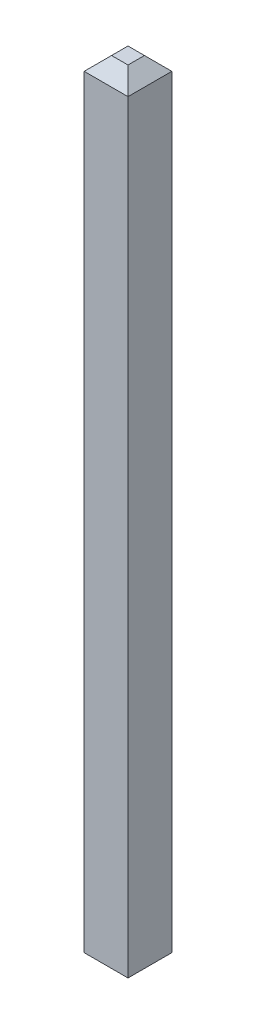
ISO-10303-21;
HEADER;
FILE_DESCRIPTION(('STEP AP214'),'2;1');
FILE_NAME('part.step','',(''),(''),'','','');
FILE_SCHEMA(('AUTOMOTIVE_DESIGN { 1 0 10303 214 1 1 1 1 }'));
ENDSEC;
DATA;
#1=APPLICATION_CONTEXT('core data for automotive mechanical design processes');
#2=APPLICATION_PROTOCOL_DEFINITION('international standard','automotive_design',2000,#1);
#3=PRODUCT_CONTEXT('',#1,'mechanical');
#4=PRODUCT('Part','Part','',(#3));
#5=PRODUCT_RELATED_PRODUCT_CATEGORY('part','',(#4));
#6=PRODUCT_DEFINITION_FORMATION('','',#4);
#7=PRODUCT_DEFINITION_CONTEXT('part definition',#1,'design');
#8=PRODUCT_DEFINITION('design','',#6,#7);
#9=PRODUCT_DEFINITION_SHAPE('','',#8);
#10=(LENGTH_UNIT() NAMED_UNIT(*) SI_UNIT(.MILLI.,.METRE.));
#11=(NAMED_UNIT(*) PLANE_ANGLE_UNIT() SI_UNIT($,.RADIAN.));
#12=(NAMED_UNIT(*) SI_UNIT($,.STERADIAN.) SOLID_ANGLE_UNIT());
#13=UNCERTAINTY_MEASURE_WITH_UNIT(LENGTH_MEASURE(1.E-05),#10,'distance_accuracy_value','');
#14=(GEOMETRIC_REPRESENTATION_CONTEXT(3) GLOBAL_UNCERTAINTY_ASSIGNED_CONTEXT((#13)) GLOBAL_UNIT_ASSIGNED_CONTEXT((#10,
#11,#12)) REPRESENTATION_CONTEXT('',''));
#15=CARTESIAN_POINT('',(0.,0.,0.));
#16=DIRECTION('',(0.,0.,1.));
#17=DIRECTION('',(1.,0.,0.));
#18=AXIS2_PLACEMENT_3D('',#15,#16,#17);
#19=CARTESIAN_POINT('',(-3.49,7.07,-0.32));
#20=DIRECTION('',(-0.707106781186548,-0.707106781186548,0.));
#21=DIRECTION('',(-0.707106781186548,0.707106781186548,0.));
#22=AXIS2_PLACEMENT_3D('',#19,#20,#21);
#23=PLANE('',#22);
#24=DIRECTION('',(0.577350269189626,-0.577350269189626,0.577350269189626));
#25=VECTOR('',#24,1.);
#26=CARTESIAN_POINT('',(-3.703333333333,7.283333333333,0.106666666667));
#27=LINE('',#26,#25);
#28=CARTESIAN_POINT('',(-3.69,7.27,0.12));
#29=VERTEX_POINT('',#28);
#30=CARTESIAN_POINT('',(-3.49,7.07,0.32));
#31=VERTEX_POINT('',#30);
#32=EDGE_CURVE('E72',#29,#31,#27,.T.);
#33=ORIENTED_EDGE('',*,*,#32,.T.);
#34=DIRECTION('',(0.,0.,1.));
#35=VECTOR('',#34,1.);
#36=CARTESIAN_POINT('',(-3.49,7.07,-0.32));
#37=LINE('',#36,#35);
#38=CARTESIAN_POINT('',(-3.49,7.07,-0.32));
#39=VERTEX_POINT('',#38);
#40=EDGE_CURVE('E166',#39,#31,#37,.T.);
#41=ORIENTED_EDGE('',*,*,#40,.F.);
#42=DIRECTION('',(0.577350269189626,-0.577350269189626,-0.577350269189626));
#43=VECTOR('',#42,1.);
#44=CARTESIAN_POINT('',(-3.49,7.07,-0.32));
#45=LINE('',#44,#43);
#46=CARTESIAN_POINT('',(-3.69,7.27,-0.12));
#47=VERTEX_POINT('',#46);
#48=EDGE_CURVE('E11',#47,#39,#45,.T.);
#49=ORIENTED_EDGE('',*,*,#48,.F.);
#50=DIRECTION('',(0.,0.,-1.));
#51=VECTOR('',#50,1.);
#52=CARTESIAN_POINT('',(-3.69,7.27,-0.32));
#53=LINE('',#52,#51);
#54=EDGE_CURVE('E167',#29,#47,#53,.T.);
#55=ORIENTED_EDGE('',*,*,#54,.F.);
#56=EDGE_LOOP('',(#33,#41,#49,#55));
#57=FACE_BOUND('',#56,.T.);
#58=ADVANCED_FACE('F17',(#57),#23,.F.);
#59=CARTESIAN_POINT('',(-3.81,7.07,-0.32));
#60=DIRECTION('',(0.,0.707106781186548,-0.707106781186548));
#61=DIRECTION('',(-1.,0.,0.));
#62=AXIS2_PLACEMENT_3D('',#59,#60,#61);
#63=PLANE('',#62);
#64=DIRECTION('',(0.577350269189626,0.577350269189626,0.577350269189626));
#65=VECTOR('',#64,1.);
#66=CARTESIAN_POINT('',(-3.996666666667,7.203333333333,-0.186666666667));
#67=LINE('',#66,#65);
#68=CARTESIAN_POINT('',(-4.13,7.07,-0.32));
#69=VERTEX_POINT('',#68);
#70=CARTESIAN_POINT('',(-3.93,7.27,-0.12));
#71=VERTEX_POINT('',#70);
#72=EDGE_CURVE('E26',#69,#71,#67,.T.);
#73=ORIENTED_EDGE('',*,*,#72,.T.);
#74=DIRECTION('',(-1.,0.,0.));
#75=VECTOR('',#74,1.);
#76=CARTESIAN_POINT('',(-4.13,7.27,-0.12));
#77=LINE('',#76,#75);
#78=EDGE_CURVE('E171',#47,#71,#77,.T.);
#79=ORIENTED_EDGE('',*,*,#78,.F.);
#80=ORIENTED_EDGE('',*,*,#48,.T.);
#81=DIRECTION('',(1.,0.,0.));
#82=VECTOR('',#81,1.);
#83=CARTESIAN_POINT('',(-3.49,7.07,-0.32));
#84=LINE('',#83,#82);
#85=EDGE_CURVE('E154',#69,#39,#84,.T.);
#86=ORIENTED_EDGE('',*,*,#85,.F.);
#87=EDGE_LOOP('',(#73,#79,#80,#86));
#88=FACE_BOUND('',#87,.T.);
#89=ADVANCED_FACE('F188',(#88),#63,.T.);
#90=CARTESIAN_POINT('',(-3.93,7.27,-0.32));
#91=DIRECTION('',(0.707106781186548,-0.707106781186548,0.));
#92=DIRECTION('',(0.,0.,-1.));
#93=AXIS2_PLACEMENT_3D('',#90,#91,#92);
#94=PLANE('',#93);
#95=DIRECTION('',(-0.577350269189626,-0.577350269189626,0.577350269189626));
#96=VECTOR('',#95,1.);
#97=CARTESIAN_POINT('',(-3.996666666667,7.203333333333,0.186666666667));
#98=LINE('',#97,#96);
#99=CARTESIAN_POINT('',(-3.93,7.27,0.12));
#100=VERTEX_POINT('',#99);
#101=CARTESIAN_POINT('',(-4.13,7.07,0.32));
#102=VERTEX_POINT('',#101);
#103=EDGE_CURVE('E39',#100,#102,#98,.T.);
#104=ORIENTED_EDGE('',*,*,#103,.F.);
#105=DIRECTION('',(0.,0.,1.));
#106=VECTOR('',#105,1.);
#107=CARTESIAN_POINT('',(-3.93,7.27,-0.32));
#108=LINE('',#107,#106);
#109=EDGE_CURVE('E175',#71,#100,#108,.T.);
#110=ORIENTED_EDGE('',*,*,#109,.F.);
#111=ORIENTED_EDGE('',*,*,#72,.F.);
#112=DIRECTION('',(0.,0.,-1.));
#113=VECTOR('',#112,1.);
#114=CARTESIAN_POINT('',(-4.13,7.07,-0.32));
#115=LINE('',#114,#113);
#116=EDGE_CURVE('E139',#102,#69,#115,.T.);
#117=ORIENTED_EDGE('',*,*,#116,.F.);
#118=EDGE_LOOP('',(#104,#110,#111,#117));
#119=FACE_BOUND('',#118,.T.);
#120=ADVANCED_FACE('F190',(#119),#94,.F.);
#121=CARTESIAN_POINT('',(-4.13,7.27,0.12));
#122=DIRECTION('',(0.,-0.707106781186548,-0.707106781186548));
#123=DIRECTION('',(0.,-0.707106781186548,0.707106781186548));
#124=AXIS2_PLACEMENT_3D('',#121,#122,#123);
#125=PLANE('',#124);
#126=ORIENTED_EDGE('',*,*,#32,.F.);
#127=DIRECTION('',(1.,0.,0.));
#128=VECTOR('',#127,1.);
#129=CARTESIAN_POINT('',(-4.13,7.27,0.12));
#130=LINE('',#129,#128);
#131=EDGE_CURVE('E179',#100,#29,#130,.T.);
#132=ORIENTED_EDGE('',*,*,#131,.F.);
#133=ORIENTED_EDGE('',*,*,#103,.T.);
#134=DIRECTION('',(-1.,0.,0.));
#135=VECTOR('',#134,1.);
#136=CARTESIAN_POINT('',(-3.81,7.07,0.32));
#137=LINE('',#136,#135);
#138=EDGE_CURVE('E143',#31,#102,#137,.T.);
#139=ORIENTED_EDGE('',*,*,#138,.F.);
#140=EDGE_LOOP('',(#126,#132,#133,#139));
#141=FACE_BOUND('',#140,.T.);
#142=ADVANCED_FACE('F272',(#141),#125,.F.);
#143=CARTESIAN_POINT('',(-4.13,7.27,-0.32));
#144=DIRECTION('',(0.,-1.,0.));
#145=DIRECTION('',(0.,0.,-1.));
#146=AXIS2_PLACEMENT_3D('',#143,#144,#145);
#147=PLANE('',#146);
#148=ORIENTED_EDGE('',*,*,#54,.T.);
#149=ORIENTED_EDGE('',*,*,#78,.T.);
#150=ORIENTED_EDGE('',*,*,#109,.T.);
#151=ORIENTED_EDGE('',*,*,#131,.T.);
#152=EDGE_LOOP('',(#148,#149,#150,#151));
#153=FACE_BOUND('',#152,.T.);
#154=ADVANCED_FACE('F192',(#153),#147,.F.);
#155=CARTESIAN_POINT('',(-3.49,7.27,-0.32));
#156=DIRECTION('',(-1.,0.,0.));
#157=DIRECTION('',(0.,1.,0.));
#158=AXIS2_PLACEMENT_3D('',#155,#156,#157);
#159=PLANE('',#158);
#160=DIRECTION('',(0.,-1.,0.));
#161=VECTOR('',#160,1.);
#162=CARTESIAN_POINT('',(-3.49,7.27,-0.32));
#163=LINE('',#162,#161);
#164=CARTESIAN_POINT('',(-3.49,-4.07,-0.32));
#165=VERTEX_POINT('',#164);
#166=EDGE_CURVE('E145',#39,#165,#163,.T.);
#167=ORIENTED_EDGE('',*,*,#166,.F.);
#168=ORIENTED_EDGE('',*,*,#40,.T.);
#169=DIRECTION('',(0.,-1.,0.));
#170=VECTOR('',#169,1.);
#171=CARTESIAN_POINT('',(-3.49,7.27,0.32));
#172=LINE('',#171,#170);
#173=CARTESIAN_POINT('',(-3.49,-4.07,0.32));
#174=VERTEX_POINT('',#173);
#175=EDGE_CURVE('E63',#31,#174,#172,.T.);
#176=ORIENTED_EDGE('',*,*,#175,.T.);
#177=DIRECTION('',(0.,0.,-1.));
#178=VECTOR('',#177,1.);
#179=CARTESIAN_POINT('',(-3.49,-4.07,-0.32));
#180=LINE('',#179,#178);
#181=EDGE_CURVE('E117',#174,#165,#180,.T.);
#182=ORIENTED_EDGE('',*,*,#181,.T.);
#183=EDGE_LOOP('',(#167,#168,#176,#182));
#184=FACE_BOUND('',#183,.T.);
#185=ADVANCED_FACE('F195',(#184),#159,.F.);
#186=CARTESIAN_POINT('',(-3.81,1.5,0.32));
#187=DIRECTION('',(0.,0.,-1.));
#188=DIRECTION('',(0.,-1.,0.));
#189=AXIS2_PLACEMENT_3D('',#186,#187,#188);
#190=PLANE('',#189);
#191=ORIENTED_EDGE('',*,*,#175,.F.);
#192=ORIENTED_EDGE('',*,*,#138,.T.);
#193=DIRECTION('',(0.,1.,0.));
#194=VECTOR('',#193,1.);
#195=CARTESIAN_POINT('',(-4.13,-4.27,0.32));
#196=LINE('',#195,#194);
#197=CARTESIAN_POINT('',(-4.13,-4.07,0.32));
#198=VERTEX_POINT('',#197);
#199=EDGE_CURVE('E134',#198,#102,#196,.T.);
#200=ORIENTED_EDGE('',*,*,#199,.F.);
#201=DIRECTION('',(1.,0.,0.));
#202=VECTOR('',#201,1.);
#203=CARTESIAN_POINT('',(-3.81,-4.07,0.32));
#204=LINE('',#203,#202);
#205=EDGE_CURVE('E106',#198,#174,#204,.T.);
#206=ORIENTED_EDGE('',*,*,#205,.T.);
#207=EDGE_LOOP('',(#191,#192,#200,#206));
#208=FACE_BOUND('',#207,.T.);
#209=ADVANCED_FACE('F142',(#208),#190,.F.);
#210=CARTESIAN_POINT('',(-3.69,-4.27,-0.32));
#211=DIRECTION('',(-0.707106781186548,0.707106781186548,0.));
#212=DIRECTION('',(0.,0.,1.));
#213=AXIS2_PLACEMENT_3D('',#210,#211,#212);
#214=PLANE('',#213);
#215=DIRECTION('',(-0.577350269189626,-0.577350269189626,0.577350269189626));
#216=VECTOR('',#215,1.);
#217=CARTESIAN_POINT('',(-3.623333333333,-4.203333333333,-0.186666666667));
#218=LINE('',#217,#216);
#219=CARTESIAN_POINT('',(-3.69,-4.27,-0.12));
#220=VERTEX_POINT('',#219);
#221=EDGE_CURVE('E204',#165,#220,#218,.T.);
#222=ORIENTED_EDGE('',*,*,#221,.F.);
#223=ORIENTED_EDGE('',*,*,#181,.F.);
#224=DIRECTION('',(-0.577350269189626,-0.577350269189626,-0.577350269189626));
#225=VECTOR('',#224,1.);
#226=CARTESIAN_POINT('',(-3.836666666667,-4.416666666667,-0.02666666666667));
#227=LINE('',#226,#225);
#228=CARTESIAN_POINT('',(-3.69,-4.27,0.12));
#229=VERTEX_POINT('',#228);
#230=EDGE_CURVE('E113',#174,#229,#227,.T.);
#231=ORIENTED_EDGE('',*,*,#230,.T.);
#232=DIRECTION('',(0.,0.,1.));
#233=VECTOR('',#232,1.);
#234=CARTESIAN_POINT('',(-3.69,-4.27,-0.32));
#235=LINE('',#234,#233);
#236=EDGE_CURVE('E231',#220,#229,#235,.T.);
#237=ORIENTED_EDGE('',*,*,#236,.F.);
#238=EDGE_LOOP('',(#222,#223,#231,#237));
#239=FACE_BOUND('',#238,.T.);
#240=ADVANCED_FACE('F233',(#239),#214,.F.);
#241=CARTESIAN_POINT('',(-3.49,-4.27,0.12));
#242=DIRECTION('',(0.,0.707106781186548,-0.707106781186548));
#243=DIRECTION('',(-1.,0.,0.));
#244=AXIS2_PLACEMENT_3D('',#241,#242,#243);
#245=PLANE('',#244);
#246=ORIENTED_EDGE('',*,*,#230,.F.);
#247=ORIENTED_EDGE('',*,*,#205,.F.);
#248=DIRECTION('',(-0.577350269189626,0.577350269189626,0.577350269189626));
#249=VECTOR('',#248,1.);
#250=CARTESIAN_POINT('',(-3.916666666667,-4.283333333333,0.106666666667));
#251=LINE('',#250,#249);
#252=CARTESIAN_POINT('',(-3.93,-4.27,0.12));
#253=VERTEX_POINT('',#252);
#254=EDGE_CURVE('E110',#253,#198,#251,.T.);
#255=ORIENTED_EDGE('',*,*,#254,.F.);
#256=DIRECTION('',(-1.,0.,0.));
#257=VECTOR('',#256,1.);
#258=CARTESIAN_POINT('',(-3.49,-4.27,0.12));
#259=LINE('',#258,#257);
#260=EDGE_CURVE('E235',#229,#253,#259,.T.);
#261=ORIENTED_EDGE('',*,*,#260,.F.);
#262=EDGE_LOOP('',(#246,#247,#255,#261));
#263=FACE_BOUND('',#262,.T.);
#264=ADVANCED_FACE('F108',(#263),#245,.F.);
#265=CARTESIAN_POINT('',(-4.13,-4.07,-0.32));
#266=DIRECTION('',(0.707106781186548,0.707106781186548,0.));
#267=DIRECTION('',(0.,0.,-1.));
#268=AXIS2_PLACEMENT_3D('',#265,#266,#267);
#269=PLANE('',#268);
#270=DIRECTION('',(0.577350269189626,-0.577350269189626,0.577350269189626));
#271=VECTOR('',#270,1.);
#272=CARTESIAN_POINT('',(-4.023333333333,-4.176666666667,-0.213333333333));
#273=LINE('',#272,#271);
#274=CARTESIAN_POINT('',(-4.13,-4.07,-0.32));
#275=VERTEX_POINT('',#274);
#276=CARTESIAN_POINT('',(-3.93,-4.27,-0.12));
#277=VERTEX_POINT('',#276);
#278=EDGE_CURVE('E212',#275,#277,#273,.T.);
#279=ORIENTED_EDGE('',*,*,#278,.T.);
#280=DIRECTION('',(0.,0.,-1.));
#281=VECTOR('',#280,1.);
#282=CARTESIAN_POINT('',(-3.93,-4.27,-0.32));
#283=LINE('',#282,#281);
#284=EDGE_CURVE('E126',#253,#277,#283,.T.);
#285=ORIENTED_EDGE('',*,*,#284,.F.);
#286=ORIENTED_EDGE('',*,*,#254,.T.);
#287=DIRECTION('',(0.,0.,1.));
#288=VECTOR('',#287,1.);
#289=CARTESIAN_POINT('',(-4.13,-4.07,-0.32));
#290=LINE('',#289,#288);
#291=EDGE_CURVE('E123',#275,#198,#290,.T.);
#292=ORIENTED_EDGE('',*,*,#291,.F.);
#293=EDGE_LOOP('',(#279,#285,#286,#292));
#294=FACE_BOUND('',#293,.T.);
#295=ADVANCED_FACE('F122',(#294),#269,.F.);
#296=CARTESIAN_POINT('',(-4.13,-4.27,-0.32));
#297=DIRECTION('',(1.,0.,0.));
#298=DIRECTION('',(0.,0.,1.));
#299=AXIS2_PLACEMENT_3D('',#296,#297,#298);
#300=PLANE('',#299);
#301=ORIENTED_EDGE('',*,*,#199,.T.);
#302=ORIENTED_EDGE('',*,*,#116,.T.);
#303=DIRECTION('',(0.,1.,0.));
#304=VECTOR('',#303,1.);
#305=CARTESIAN_POINT('',(-4.13,-4.27,-0.32));
#306=LINE('',#305,#304);
#307=EDGE_CURVE('E136',#275,#69,#306,.T.);
#308=ORIENTED_EDGE('',*,*,#307,.F.);
#309=ORIENTED_EDGE('',*,*,#291,.T.);
#310=EDGE_LOOP('',(#301,#302,#308,#309));
#311=FACE_BOUND('',#310,.T.);
#312=ADVANCED_FACE('F132',(#311),#300,.F.);
#313=CARTESIAN_POINT('',(-3.81,1.5,-0.32));
#314=DIRECTION('',(0.,0.,-1.));
#315=DIRECTION('',(0.,-1.,0.));
#316=AXIS2_PLACEMENT_3D('',#313,#314,#315);
#317=PLANE('',#316);
#318=ORIENTED_EDGE('',*,*,#307,.T.);
#319=ORIENTED_EDGE('',*,*,#85,.T.);
#320=ORIENTED_EDGE('',*,*,#166,.T.);
#321=DIRECTION('',(-1.,0.,0.));
#322=VECTOR('',#321,1.);
#323=CARTESIAN_POINT('',(-4.13,-4.07,-0.32));
#324=LINE('',#323,#322);
#325=EDGE_CURVE('E209',#165,#275,#324,.T.);
#326=ORIENTED_EDGE('',*,*,#325,.T.);
#327=EDGE_LOOP('',(#318,#319,#320,#326));
#328=FACE_BOUND('',#327,.T.);
#329=ADVANCED_FACE('F198',(#328),#317,.T.);
#330=CARTESIAN_POINT('',(-3.81,-4.07,-0.32));
#331=DIRECTION('',(0.,-0.707106781186548,-0.707106781186548));
#332=DIRECTION('',(0.,-0.707106781186548,0.707106781186548));
#333=AXIS2_PLACEMENT_3D('',#330,#331,#332);
#334=PLANE('',#333);
#335=ORIENTED_EDGE('',*,*,#278,.F.);
#336=ORIENTED_EDGE('',*,*,#325,.F.);
#337=ORIENTED_EDGE('',*,*,#221,.T.);
#338=DIRECTION('',(1.,0.,0.));
#339=VECTOR('',#338,1.);
#340=CARTESIAN_POINT('',(-3.49,-4.27,-0.12));
#341=LINE('',#340,#339);
#342=EDGE_CURVE('E208',#277,#220,#341,.T.);
#343=ORIENTED_EDGE('',*,*,#342,.F.);
#344=EDGE_LOOP('',(#335,#336,#337,#343));
#345=FACE_BOUND('',#344,.T.);
#346=ADVANCED_FACE('F223',(#345),#334,.T.);
#347=CARTESIAN_POINT('',(-3.49,-4.27,-0.32));
#348=DIRECTION('',(0.,1.,0.));
#349=DIRECTION('',(0.,0.,-1.));
#350=AXIS2_PLACEMENT_3D('',#347,#348,#349);
#351=PLANE('',#350);
#352=ORIENTED_EDGE('',*,*,#236,.T.);
#353=ORIENTED_EDGE('',*,*,#260,.T.);
#354=ORIENTED_EDGE('',*,*,#284,.T.);
#355=ORIENTED_EDGE('',*,*,#342,.T.);
#356=EDGE_LOOP('',(#352,#353,#354,#355));
#357=FACE_BOUND('',#356,.T.);
#358=ADVANCED_FACE('F230',(#357),#351,.F.);
#359=CLOSED_SHELL('',(#58,#89,#120,#142,#154,#185,#209,#240,#264,#295,#312,#329,#346,#358));
#360=MANIFOLD_SOLID_BREP('B1',#359);
#361=ADVANCED_BREP_SHAPE_REPRESENTATION('',(#18,#360),#14);
#362=SHAPE_DEFINITION_REPRESENTATION(#9,#361);
ENDSEC;
END-ISO-10303-21;
